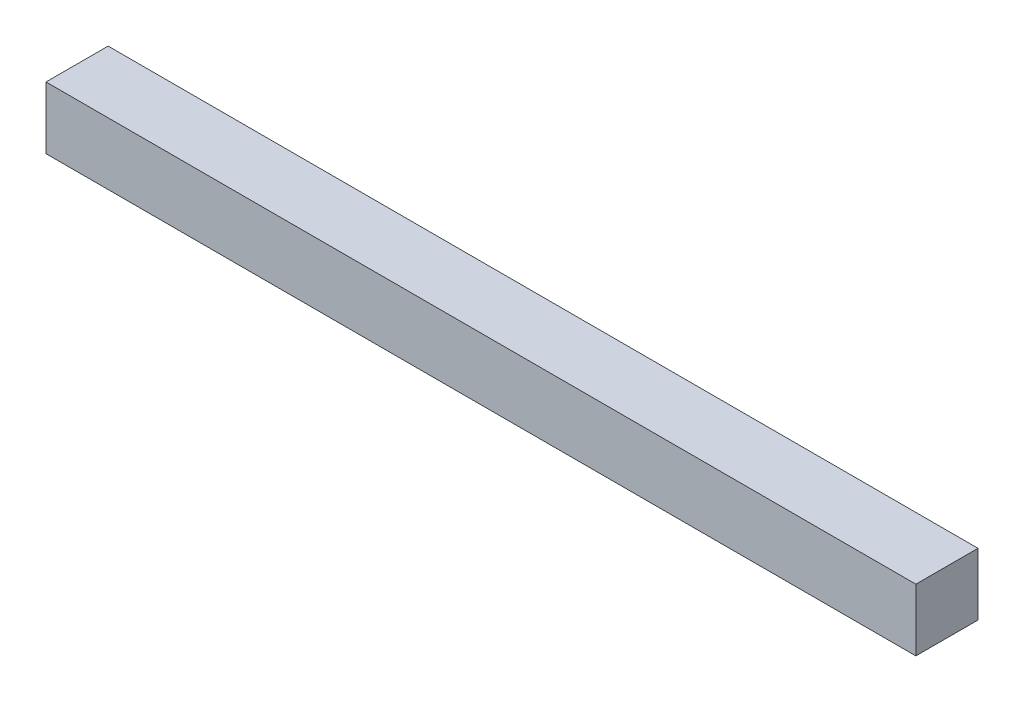
ISO-10303-21;
HEADER;
FILE_DESCRIPTION(('STEP AP214'),'2;1');
FILE_NAME('part.step','',(''),(''),'','','');
FILE_SCHEMA(('AUTOMOTIVE_DESIGN { 1 0 10303 214 1 1 1 1 }'));
ENDSEC;
DATA;
#1=APPLICATION_CONTEXT('core data for automotive mechanical design processes');
#2=APPLICATION_PROTOCOL_DEFINITION('international standard','automotive_design',2000,#1);
#3=PRODUCT_CONTEXT('',#1,'mechanical');
#4=PRODUCT('Part','Part','',(#3));
#5=PRODUCT_RELATED_PRODUCT_CATEGORY('part','',(#4));
#6=PRODUCT_DEFINITION_FORMATION('','',#4);
#7=PRODUCT_DEFINITION_CONTEXT('part definition',#1,'design');
#8=PRODUCT_DEFINITION('design','',#6,#7);
#9=PRODUCT_DEFINITION_SHAPE('','',#8);
#10=(LENGTH_UNIT() NAMED_UNIT(*) SI_UNIT(.MILLI.,.METRE.));
#11=(NAMED_UNIT(*) PLANE_ANGLE_UNIT() SI_UNIT($,.RADIAN.));
#12=(NAMED_UNIT(*) SI_UNIT($,.STERADIAN.) SOLID_ANGLE_UNIT());
#13=UNCERTAINTY_MEASURE_WITH_UNIT(LENGTH_MEASURE(1.E-05),#10,'distance_accuracy_value','');
#14=(GEOMETRIC_REPRESENTATION_CONTEXT(3) GLOBAL_UNCERTAINTY_ASSIGNED_CONTEXT((#13)) GLOBAL_UNIT_ASSIGNED_CONTEXT((#10,
#11,#12)) REPRESENTATION_CONTEXT('',''));
#15=CARTESIAN_POINT('',(0.,0.,0.));
#16=DIRECTION('',(0.,0.,1.));
#17=DIRECTION('',(1.,0.,0.));
#18=AXIS2_PLACEMENT_3D('',#15,#16,#17);
#19=CARTESIAN_POINT('',(0.,5.,0.));
#20=DIRECTION('',(1.,0.,0.));
#21=DIRECTION('',(0.,0.,-1.));
#22=AXIS2_PLACEMENT_3D('',#19,#20,#21);
#23=PLANE('',#22);
#24=DIRECTION('',(0.,0.,1.));
#25=VECTOR('',#24,1.);
#26=CARTESIAN_POINT('',(0.,0.,0.));
#27=LINE('',#26,#25);
#28=CARTESIAN_POINT('',(0.,0.,-5.));
#29=VERTEX_POINT('',#28);
#30=CARTESIAN_POINT('',(0.,0.,0.));
#31=VERTEX_POINT('',#30);
#32=EDGE_CURVE('E96',#29,#31,#27,.T.);
#33=ORIENTED_EDGE('',*,*,#32,.T.);
#34=DIRECTION('',(0.,-1.,0.));
#35=VECTOR('',#34,1.);
#36=CARTESIAN_POINT('',(0.,5.,0.));
#37=LINE('',#36,#35);
#38=CARTESIAN_POINT('',(0.,5.,0.));
#39=VERTEX_POINT('',#38);
#40=EDGE_CURVE('E11',#39,#31,#37,.T.);
#41=ORIENTED_EDGE('',*,*,#40,.F.);
#42=DIRECTION('',(0.,0.,1.));
#43=VECTOR('',#42,1.);
#44=CARTESIAN_POINT('',(0.,5.,0.));
#45=LINE('',#44,#43);
#46=CARTESIAN_POINT('',(0.,5.,-5.));
#47=VERTEX_POINT('',#46);
#48=EDGE_CURVE('E84',#47,#39,#45,.T.);
#49=ORIENTED_EDGE('',*,*,#48,.F.);
#50=DIRECTION('',(0.,-1.,0.));
#51=VECTOR('',#50,1.);
#52=CARTESIAN_POINT('',(0.,5.,-5.));
#53=LINE('',#52,#51);
#54=EDGE_CURVE('E92',#47,#29,#53,.T.);
#55=ORIENTED_EDGE('',*,*,#54,.T.);
#56=EDGE_LOOP('',(#33,#41,#49,#55));
#57=FACE_BOUND('',#56,.T.);
#58=ADVANCED_FACE('F33',(#57),#23,.F.);
#59=CARTESIAN_POINT('',(0.,5.,0.));
#60=DIRECTION('',(0.,0.,-1.));
#61=DIRECTION('',(-1.,0.,0.));
#62=AXIS2_PLACEMENT_3D('',#59,#60,#61);
#63=PLANE('',#62);
#64=DIRECTION('',(1.,0.,0.));
#65=VECTOR('',#64,1.);
#66=CARTESIAN_POINT('',(0.,0.,0.));
#67=LINE('',#66,#65);
#68=CARTESIAN_POINT('',(70.,0.,0.));
#69=VERTEX_POINT('',#68);
#70=EDGE_CURVE('E88',#31,#69,#67,.T.);
#71=ORIENTED_EDGE('',*,*,#70,.T.);
#72=DIRECTION('',(0.,-1.,0.));
#73=VECTOR('',#72,1.);
#74=CARTESIAN_POINT('',(70.,5.,0.));
#75=LINE('',#74,#73);
#76=CARTESIAN_POINT('',(70.,5.,0.));
#77=VERTEX_POINT('',#76);
#78=EDGE_CURVE('E41',#77,#69,#75,.T.);
#79=ORIENTED_EDGE('',*,*,#78,.F.);
#80=DIRECTION('',(1.,0.,0.));
#81=VECTOR('',#80,1.);
#82=CARTESIAN_POINT('',(0.,5.,0.));
#83=LINE('',#82,#81);
#84=EDGE_CURVE('E79',#39,#77,#83,.T.);
#85=ORIENTED_EDGE('',*,*,#84,.F.);
#86=ORIENTED_EDGE('',*,*,#40,.T.);
#87=EDGE_LOOP('',(#71,#79,#85,#86));
#88=FACE_BOUND('',#87,.T.);
#89=ADVANCED_FACE('F87',(#88),#63,.F.);
#90=CARTESIAN_POINT('',(70.,5.,0.));
#91=DIRECTION('',(-1.,0.,0.));
#92=DIRECTION('',(0.,0.,1.));
#93=AXIS2_PLACEMENT_3D('',#90,#91,#92);
#94=PLANE('',#93);
#95=DIRECTION('',(0.,0.,-1.));
#96=VECTOR('',#95,1.);
#97=CARTESIAN_POINT('',(70.,0.,0.));
#98=LINE('',#97,#96);
#99=CARTESIAN_POINT('',(70.,0.,-5.));
#100=VERTEX_POINT('',#99);
#101=EDGE_CURVE('E66',#69,#100,#98,.T.);
#102=ORIENTED_EDGE('',*,*,#101,.T.);
#103=DIRECTION('',(0.,-1.,0.));
#104=VECTOR('',#103,1.);
#105=CARTESIAN_POINT('',(70.,5.,-5.));
#106=LINE('',#105,#104);
#107=CARTESIAN_POINT('',(70.,5.,-5.));
#108=VERTEX_POINT('',#107);
#109=EDGE_CURVE('E89',#108,#100,#106,.T.);
#110=ORIENTED_EDGE('',*,*,#109,.F.);
#111=DIRECTION('',(0.,0.,-1.));
#112=VECTOR('',#111,1.);
#113=CARTESIAN_POINT('',(70.,5.,0.));
#114=LINE('',#113,#112);
#115=EDGE_CURVE('E82',#77,#108,#114,.T.);
#116=ORIENTED_EDGE('',*,*,#115,.F.);
#117=ORIENTED_EDGE('',*,*,#78,.T.);
#118=EDGE_LOOP('',(#102,#110,#116,#117));
#119=FACE_BOUND('',#118,.T.);
#120=ADVANCED_FACE('F90',(#119),#94,.F.);
#121=CARTESIAN_POINT('',(0.,5.,-5.));
#122=DIRECTION('',(0.,0.,1.));
#123=DIRECTION('',(1.,0.,0.));
#124=AXIS2_PLACEMENT_3D('',#121,#122,#123);
#125=PLANE('',#124);
#126=DIRECTION('',(-1.,0.,0.));
#127=VECTOR('',#126,1.);
#128=CARTESIAN_POINT('',(0.,0.,-5.));
#129=LINE('',#128,#127);
#130=EDGE_CURVE('E72',#100,#29,#129,.T.);
#131=ORIENTED_EDGE('',*,*,#130,.T.);
#132=ORIENTED_EDGE('',*,*,#54,.F.);
#133=DIRECTION('',(-1.,0.,0.));
#134=VECTOR('',#133,1.);
#135=CARTESIAN_POINT('',(0.,5.,-5.));
#136=LINE('',#135,#134);
#137=EDGE_CURVE('E49',#108,#47,#136,.T.);
#138=ORIENTED_EDGE('',*,*,#137,.F.);
#139=ORIENTED_EDGE('',*,*,#109,.T.);
#140=EDGE_LOOP('',(#131,#132,#138,#139));
#141=FACE_BOUND('',#140,.T.);
#142=ADVANCED_FACE('F103',(#141),#125,.F.);
#143=CARTESIAN_POINT('',(0.,5.,0.));
#144=DIRECTION('',(0.,-1.,0.));
#145=DIRECTION('',(0.,0.,-1.));
#146=AXIS2_PLACEMENT_3D('',#143,#144,#145);
#147=PLANE('',#146);
#148=ORIENTED_EDGE('',*,*,#48,.T.);
#149=ORIENTED_EDGE('',*,*,#84,.T.);
#150=ORIENTED_EDGE('',*,*,#115,.T.);
#151=ORIENTED_EDGE('',*,*,#137,.T.);
#152=EDGE_LOOP('',(#148,#149,#150,#151));
#153=FACE_BOUND('',#152,.T.);
#154=ADVANCED_FACE('F80',(#153),#147,.F.);
#155=CARTESIAN_POINT('',(0.,0.,0.));
#156=DIRECTION('',(0.,-1.,0.));
#157=DIRECTION('',(0.,0.,-1.));
#158=AXIS2_PLACEMENT_3D('',#155,#156,#157);
#159=PLANE('',#158);
#160=ORIENTED_EDGE('',*,*,#32,.F.);
#161=ORIENTED_EDGE('',*,*,#130,.F.);
#162=ORIENTED_EDGE('',*,*,#101,.F.);
#163=ORIENTED_EDGE('',*,*,#70,.F.);
#164=EDGE_LOOP('',(#160,#161,#162,#163));
#165=FACE_BOUND('',#164,.T.);
#166=ADVANCED_FACE('F106',(#165),#159,.T.);
#167=CLOSED_SHELL('',(#58,#89,#120,#142,#154,#166));
#168=MANIFOLD_SOLID_BREP('B2',#167);
#169=ADVANCED_BREP_SHAPE_REPRESENTATION('',(#18,#168),#14);
#170=SHAPE_DEFINITION_REPRESENTATION(#9,#169);
ENDSEC;
END-ISO-10303-21;
